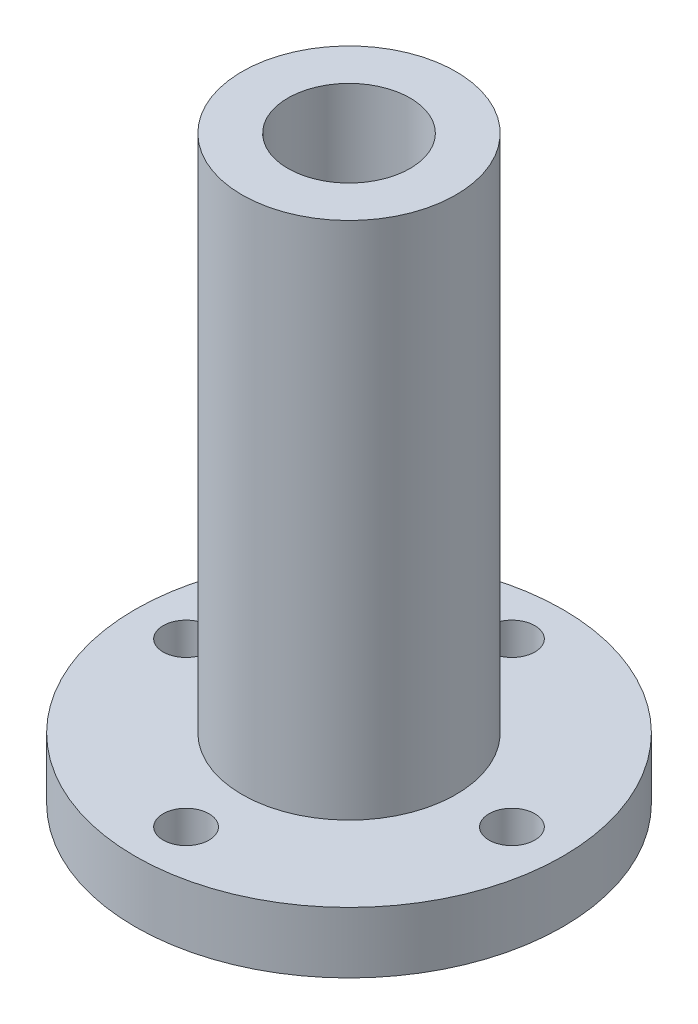
ISO-10303-21;
HEADER;
FILE_DESCRIPTION(('STEP AP214'),'2;1');
FILE_NAME('part.step','',(''),(''),'','','');
FILE_SCHEMA(('AUTOMOTIVE_DESIGN { 1 0 10303 214 1 1 1 1 }'));
ENDSEC;
DATA;
#1=APPLICATION_CONTEXT('core data for automotive mechanical design processes');
#2=APPLICATION_PROTOCOL_DEFINITION('international standard','automotive_design',2000,#1);
#3=PRODUCT_CONTEXT('',#1,'mechanical');
#4=PRODUCT('Part','Part','',(#3));
#5=PRODUCT_RELATED_PRODUCT_CATEGORY('part','',(#4));
#6=PRODUCT_DEFINITION_FORMATION('','',#4);
#7=PRODUCT_DEFINITION_CONTEXT('part definition',#1,'design');
#8=PRODUCT_DEFINITION('design','',#6,#7);
#9=PRODUCT_DEFINITION_SHAPE('','',#8);
#10=(LENGTH_UNIT() NAMED_UNIT(*) SI_UNIT(.MILLI.,.METRE.));
#11=(NAMED_UNIT(*) PLANE_ANGLE_UNIT() SI_UNIT($,.RADIAN.));
#12=(NAMED_UNIT(*) SI_UNIT($,.STERADIAN.) SOLID_ANGLE_UNIT());
#13=UNCERTAINTY_MEASURE_WITH_UNIT(LENGTH_MEASURE(1.E-05),#10,'distance_accuracy_value','');
#14=(GEOMETRIC_REPRESENTATION_CONTEXT(3) GLOBAL_UNCERTAINTY_ASSIGNED_CONTEXT((#13)) GLOBAL_UNIT_ASSIGNED_CONTEXT((#10,
#11,#12)) REPRESENTATION_CONTEXT('',''));
#15=CARTESIAN_POINT('',(0.,0.,0.));
#16=DIRECTION('',(0.,0.,1.));
#17=DIRECTION('',(1.,0.,0.));
#18=AXIS2_PLACEMENT_3D('',#15,#16,#17);
#19=CARTESIAN_POINT('',(0.,6.,0.));
#20=DIRECTION('',(0.,1.,0.));
#21=DIRECTION('',(0.,0.,1.));
#22=AXIS2_PLACEMENT_3D('',#19,#20,#21);
#23=PLANE('',#22);
#24=CARTESIAN_POINT('',(-16.,6.,0.));
#25=DIRECTION('',(0.,1.,0.));
#26=DIRECTION('',(0.,0.,1.));
#27=AXIS2_PLACEMENT_3D('',#24,#25,#26);
#28=CIRCLE('',#27,2.25);
#29=CARTESIAN_POINT('',(-16.,6.,2.25));
#30=VERTEX_POINT('',#29);
#31=EDGE_CURVE('E77',#30,#30,#28,.F.);
#32=ORIENTED_EDGE('',*,*,#31,.T.);
#33=EDGE_LOOP('',(#32));
#34=FACE_BOUND('',#33,.T.);
#35=CARTESIAN_POINT('',(0.,6.,16.));
#36=DIRECTION('',(0.,1.,0.));
#37=DIRECTION('',(0.,0.,1.));
#38=AXIS2_PLACEMENT_3D('',#35,#36,#37);
#39=CIRCLE('',#38,2.25);
#40=CARTESIAN_POINT('',(0.,6.,18.25));
#41=VERTEX_POINT('',#40);
#42=EDGE_CURVE('E71',#41,#41,#39,.F.);
#43=ORIENTED_EDGE('',*,*,#42,.T.);
#44=EDGE_LOOP('',(#43));
#45=FACE_BOUND('',#44,.T.);
#46=CARTESIAN_POINT('',(16.,6.,0.));
#47=DIRECTION('',(0.,1.,0.));
#48=DIRECTION('',(0.,0.,1.));
#49=AXIS2_PLACEMENT_3D('',#46,#47,#48);
#50=CIRCLE('',#49,2.25);
#51=CARTESIAN_POINT('',(16.,6.,2.25));
#52=VERTEX_POINT('',#51);
#53=EDGE_CURVE('E65',#52,#52,#50,.F.);
#54=ORIENTED_EDGE('',*,*,#53,.T.);
#55=EDGE_LOOP('',(#54));
#56=FACE_BOUND('',#55,.T.);
#57=CARTESIAN_POINT('',(0.,6.,-16.));
#58=DIRECTION('',(0.,1.,0.));
#59=DIRECTION('',(0.,0.,1.));
#60=AXIS2_PLACEMENT_3D('',#57,#58,#59);
#61=CIRCLE('',#60,2.25);
#62=CARTESIAN_POINT('',(0.,6.,-13.75));
#63=VERTEX_POINT('',#62);
#64=EDGE_CURVE('E59',#63,#63,#61,.F.);
#65=ORIENTED_EDGE('',*,*,#64,.T.);
#66=EDGE_LOOP('',(#65));
#67=FACE_BOUND('',#66,.T.);
#68=CARTESIAN_POINT('',(0.,6.,0.));
#69=DIRECTION('',(0.,1.,0.));
#70=DIRECTION('',(0.,0.,1.));
#71=AXIS2_PLACEMENT_3D('',#68,#69,#70);
#72=CIRCLE('',#71,21.);
#73=CARTESIAN_POINT('',(0.,6.,21.));
#74=VERTEX_POINT('',#73);
#75=EDGE_CURVE('E10',#74,#74,#72,.T.);
#76=ORIENTED_EDGE('',*,*,#75,.T.);
#77=EDGE_LOOP('',(#76));
#78=FACE_BOUND('',#77,.T.);
#79=CARTESIAN_POINT('',(0.,6.,0.));
#80=DIRECTION('',(0.,1.,0.));
#81=DIRECTION('',(0.,0.,1.));
#82=AXIS2_PLACEMENT_3D('',#79,#80,#81);
#83=CIRCLE('',#82,10.5);
#84=CARTESIAN_POINT('',(0.,6.,10.5));
#85=VERTEX_POINT('',#84);
#86=EDGE_CURVE('E50',#85,#85,#83,.T.);
#87=ORIENTED_EDGE('',*,*,#86,.F.);
#88=EDGE_LOOP('',(#87));
#89=FACE_BOUND('',#88,.T.);
#90=ADVANCED_FACE('F34',(#34,#45,#56,#67,#78,#89),#23,.T.);
#91=CARTESIAN_POINT('',(0.,0.,0.));
#92=DIRECTION('',(0.,1.,0.));
#93=DIRECTION('',(0.,0.,1.));
#94=AXIS2_PLACEMENT_3D('',#91,#92,#93);
#95=PLANE('',#94);
#96=CARTESIAN_POINT('',(-16.,0.,0.));
#97=DIRECTION('',(0.,-1.,0.));
#98=DIRECTION('',(0.,0.,-1.));
#99=AXIS2_PLACEMENT_3D('',#96,#97,#98);
#100=CIRCLE('',#99,2.25);
#101=CARTESIAN_POINT('',(-16.,0.,-2.25));
#102=VERTEX_POINT('',#101);
#103=EDGE_CURVE('E58',#102,#102,#100,.T.);
#104=ORIENTED_EDGE('',*,*,#103,.F.);
#105=EDGE_LOOP('',(#104));
#106=FACE_BOUND('',#105,.T.);
#107=CARTESIAN_POINT('',(0.,0.,16.));
#108=DIRECTION('',(0.,-1.,0.));
#109=DIRECTION('',(0.,0.,-1.));
#110=AXIS2_PLACEMENT_3D('',#107,#108,#109);
#111=CIRCLE('',#110,2.25);
#112=CARTESIAN_POINT('',(0.,0.,13.75));
#113=VERTEX_POINT('',#112);
#114=EDGE_CURVE('E74',#113,#113,#111,.T.);
#115=ORIENTED_EDGE('',*,*,#114,.F.);
#116=EDGE_LOOP('',(#115));
#117=FACE_BOUND('',#116,.T.);
#118=CARTESIAN_POINT('',(16.,0.,0.));
#119=DIRECTION('',(0.,-1.,0.));
#120=DIRECTION('',(0.,0.,-1.));
#121=AXIS2_PLACEMENT_3D('',#118,#119,#120);
#122=CIRCLE('',#121,2.25);
#123=CARTESIAN_POINT('',(16.,0.,-2.25));
#124=VERTEX_POINT('',#123);
#125=EDGE_CURVE('E68',#124,#124,#122,.T.);
#126=ORIENTED_EDGE('',*,*,#125,.F.);
#127=EDGE_LOOP('',(#126));
#128=FACE_BOUND('',#127,.T.);
#129=CARTESIAN_POINT('',(0.,0.,-16.));
#130=DIRECTION('',(0.,-1.,0.));
#131=DIRECTION('',(0.,0.,-1.));
#132=AXIS2_PLACEMENT_3D('',#129,#130,#131);
#133=CIRCLE('',#132,2.25);
#134=CARTESIAN_POINT('',(0.,0.,-18.25));
#135=VERTEX_POINT('',#134);
#136=EDGE_CURVE('E62',#135,#135,#133,.T.);
#137=ORIENTED_EDGE('',*,*,#136,.F.);
#138=EDGE_LOOP('',(#137));
#139=FACE_BOUND('',#138,.T.);
#140=CARTESIAN_POINT('',(0.,0.,0.));
#141=DIRECTION('',(0.,1.,0.));
#142=DIRECTION('',(0.,0.,1.));
#143=AXIS2_PLACEMENT_3D('',#140,#141,#142);
#144=CIRCLE('',#143,21.);
#145=CARTESIAN_POINT('',(0.,0.,21.));
#146=VERTEX_POINT('',#145);
#147=EDGE_CURVE('E38',#146,#146,#144,.T.);
#148=ORIENTED_EDGE('',*,*,#147,.F.);
#149=EDGE_LOOP('',(#148));
#150=FACE_BOUND('',#149,.T.);
#151=CARTESIAN_POINT('',(0.,0.,0.));
#152=DIRECTION('',(0.,1.,0.));
#153=DIRECTION('',(0.,0.,1.));
#154=AXIS2_PLACEMENT_3D('',#151,#152,#153);
#155=CIRCLE('',#154,6.);
#156=CARTESIAN_POINT('',(0.,0.,6.));
#157=VERTEX_POINT('',#156);
#158=EDGE_CURVE('E45',#157,#157,#155,.T.);
#159=ORIENTED_EDGE('',*,*,#158,.T.);
#160=EDGE_LOOP('',(#159));
#161=FACE_BOUND('',#160,.T.);
#162=ADVANCED_FACE('F85',(#106,#117,#128,#139,#150,#161),#95,.F.);
#163=CARTESIAN_POINT('',(0.,6.,0.));
#164=DIRECTION('',(0.,-1.,0.));
#165=DIRECTION('',(0.,0.,-1.));
#166=AXIS2_PLACEMENT_3D('',#163,#164,#165);
#167=CYLINDRICAL_SURFACE('',#166,21.);
#168=ORIENTED_EDGE('',*,*,#75,.F.);
#169=EDGE_LOOP('',(#168));
#170=FACE_BOUND('',#169,.T.);
#171=ORIENTED_EDGE('',*,*,#147,.T.);
#172=EDGE_LOOP('',(#171));
#173=FACE_BOUND('',#172,.T.);
#174=ADVANCED_FACE('F36',(#170,#173),#167,.T.);
#175=CARTESIAN_POINT('',(0.,6.,0.));
#176=DIRECTION('',(0.,-1.,0.));
#177=DIRECTION('',(0.,0.,-1.));
#178=AXIS2_PLACEMENT_3D('',#175,#176,#177);
#179=CYLINDRICAL_SURFACE('',#178,6.);
#180=ORIENTED_EDGE('',*,*,#158,.F.);
#181=EDGE_LOOP('',(#180));
#182=FACE_BOUND('',#181,.T.);
#183=CARTESIAN_POINT('',(0.,57.,0.));
#184=DIRECTION('',(0.,1.,0.));
#185=DIRECTION('',(0.,0.,1.));
#186=AXIS2_PLACEMENT_3D('',#183,#184,#185);
#187=CIRCLE('',#186,6.);
#188=CARTESIAN_POINT('',(0.,57.,6.));
#189=VERTEX_POINT('',#188);
#190=EDGE_CURVE('E53',#189,#189,#187,.T.);
#191=ORIENTED_EDGE('',*,*,#190,.T.);
#192=EDGE_LOOP('',(#191));
#193=FACE_BOUND('',#192,.T.);
#194=ADVANCED_FACE('F98',(#182,#193),#179,.F.);
#195=CARTESIAN_POINT('',(0.,57.,0.));
#196=DIRECTION('',(0.,1.,0.));
#197=DIRECTION('',(0.,0.,1.));
#198=AXIS2_PLACEMENT_3D('',#195,#196,#197);
#199=PLANE('',#198);
#200=CARTESIAN_POINT('',(0.,57.,0.));
#201=DIRECTION('',(0.,1.,0.));
#202=DIRECTION('',(0.,0.,1.));
#203=AXIS2_PLACEMENT_3D('',#200,#201,#202);
#204=CIRCLE('',#203,10.5);
#205=CARTESIAN_POINT('',(0.,57.,10.5));
#206=VERTEX_POINT('',#205);
#207=EDGE_CURVE('E49',#206,#206,#204,.T.);
#208=ORIENTED_EDGE('',*,*,#207,.T.);
#209=EDGE_LOOP('',(#208));
#210=FACE_BOUND('',#209,.T.);
#211=ORIENTED_EDGE('',*,*,#190,.F.);
#212=EDGE_LOOP('',(#211));
#213=FACE_BOUND('',#212,.T.);
#214=ADVANCED_FACE('F101',(#210,#213),#199,.T.);
#215=CARTESIAN_POINT('',(0.,57.,0.));
#216=DIRECTION('',(0.,-1.,0.));
#217=DIRECTION('',(0.,0.,-1.));
#218=AXIS2_PLACEMENT_3D('',#215,#216,#217);
#219=CYLINDRICAL_SURFACE('',#218,10.5);
#220=ORIENTED_EDGE('',*,*,#207,.F.);
#221=EDGE_LOOP('',(#220));
#222=FACE_BOUND('',#221,.T.);
#223=ORIENTED_EDGE('',*,*,#86,.T.);
#224=EDGE_LOOP('',(#223));
#225=FACE_BOUND('',#224,.T.);
#226=ADVANCED_FACE('F106',(#222,#225),#219,.T.);
#227=CARTESIAN_POINT('',(0.,57.001,-16.));
#228=DIRECTION('',(0.,-1.,0.));
#229=DIRECTION('',(0.,0.,-1.));
#230=AXIS2_PLACEMENT_3D('',#227,#228,#229);
#231=CYLINDRICAL_SURFACE('',#230,2.25);
#232=ORIENTED_EDGE('',*,*,#64,.F.);
#233=EDGE_LOOP('',(#232));
#234=FACE_BOUND('',#233,.T.);
#235=ORIENTED_EDGE('',*,*,#136,.T.);
#236=EDGE_LOOP('',(#235));
#237=FACE_BOUND('',#236,.T.);
#238=ADVANCED_FACE('F112',(#234,#237),#231,.F.);
#239=CARTESIAN_POINT('',(16.,57.001,0.));
#240=DIRECTION('',(0.,-1.,0.));
#241=DIRECTION('',(0.,0.,-1.));
#242=AXIS2_PLACEMENT_3D('',#239,#240,#241);
#243=CYLINDRICAL_SURFACE('',#242,2.25);
#244=ORIENTED_EDGE('',*,*,#53,.F.);
#245=EDGE_LOOP('',(#244));
#246=FACE_BOUND('',#245,.T.);
#247=ORIENTED_EDGE('',*,*,#125,.T.);
#248=EDGE_LOOP('',(#247));
#249=FACE_BOUND('',#248,.T.);
#250=ADVANCED_FACE('F134',(#246,#249),#243,.F.);
#251=CARTESIAN_POINT('',(0.,57.001,16.));
#252=DIRECTION('',(0.,-1.,0.));
#253=DIRECTION('',(0.,0.,-1.));
#254=AXIS2_PLACEMENT_3D('',#251,#252,#253);
#255=CYLINDRICAL_SURFACE('',#254,2.25);
#256=ORIENTED_EDGE('',*,*,#42,.F.);
#257=EDGE_LOOP('',(#256));
#258=FACE_BOUND('',#257,.T.);
#259=ORIENTED_EDGE('',*,*,#114,.T.);
#260=EDGE_LOOP('',(#259));
#261=FACE_BOUND('',#260,.T.);
#262=ADVANCED_FACE('F138',(#258,#261),#255,.F.);
#263=CARTESIAN_POINT('',(-16.,57.001,0.));
#264=DIRECTION('',(0.,-1.,0.));
#265=DIRECTION('',(0.,0.,-1.));
#266=AXIS2_PLACEMENT_3D('',#263,#264,#265);
#267=CYLINDRICAL_SURFACE('',#266,2.25);
#268=ORIENTED_EDGE('',*,*,#31,.F.);
#269=EDGE_LOOP('',(#268));
#270=FACE_BOUND('',#269,.T.);
#271=ORIENTED_EDGE('',*,*,#103,.T.);
#272=EDGE_LOOP('',(#271));
#273=FACE_BOUND('',#272,.T.);
#274=ADVANCED_FACE('F83',(#270,#273),#267,.F.);
#275=CLOSED_SHELL('',(#90,#162,#174,#194,#214,#226,#238,#250,#262,#274));
#276=MANIFOLD_SOLID_BREP('B2',#275);
#277=ADVANCED_BREP_SHAPE_REPRESENTATION('',(#18,#276),#14);
#278=SHAPE_DEFINITION_REPRESENTATION(#9,#277);
ENDSEC;
END-ISO-10303-21;
